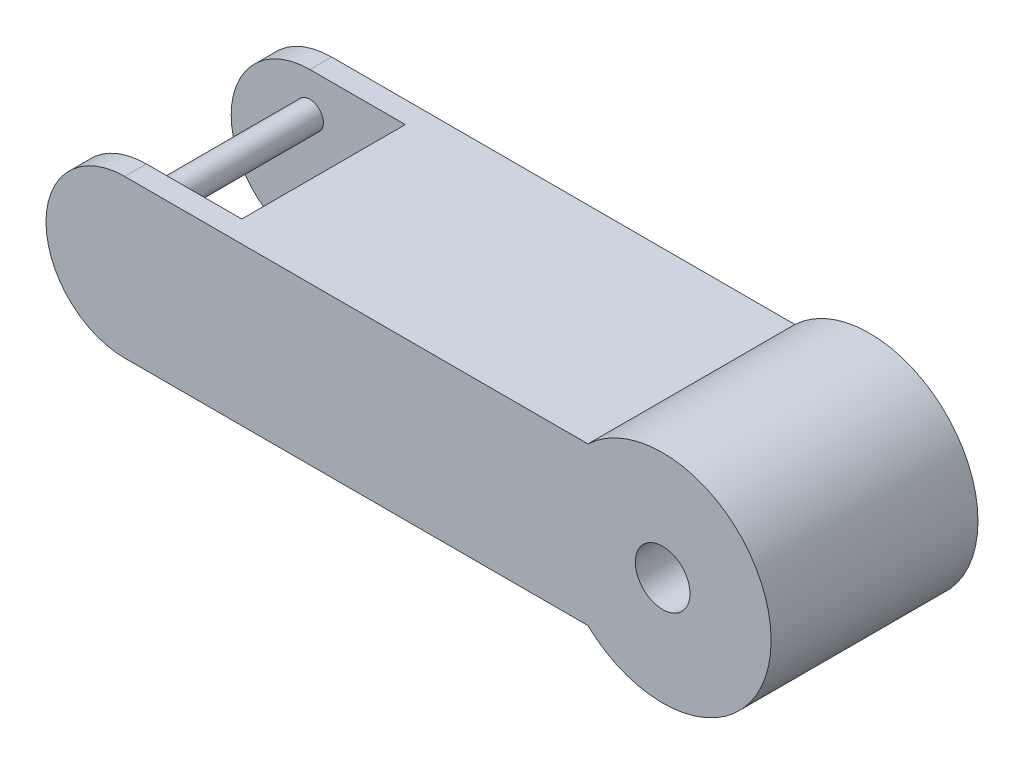
ISO-10303-21;
HEADER;
FILE_DESCRIPTION(('STEP AP214'),'2;1');
FILE_NAME('part.step','',(''),(''),'','','');
FILE_SCHEMA(('AUTOMOTIVE_DESIGN { 1 0 10303 214 1 1 1 1 }'));
ENDSEC;
DATA;
#1=APPLICATION_CONTEXT('core data for automotive mechanical design processes');
#2=APPLICATION_PROTOCOL_DEFINITION('international standard','automotive_design',2000,#1);
#3=PRODUCT_CONTEXT('',#1,'mechanical');
#4=PRODUCT('Part','Part','',(#3));
#5=PRODUCT_RELATED_PRODUCT_CATEGORY('part','',(#4));
#6=PRODUCT_DEFINITION_FORMATION('','',#4);
#7=PRODUCT_DEFINITION_CONTEXT('part definition',#1,'design');
#8=PRODUCT_DEFINITION('design','',#6,#7);
#9=PRODUCT_DEFINITION_SHAPE('','',#8);
#10=(LENGTH_UNIT() NAMED_UNIT(*) SI_UNIT(.MILLI.,.METRE.));
#11=(NAMED_UNIT(*) PLANE_ANGLE_UNIT() SI_UNIT($,.RADIAN.));
#12=(NAMED_UNIT(*) SI_UNIT($,.STERADIAN.) SOLID_ANGLE_UNIT());
#13=UNCERTAINTY_MEASURE_WITH_UNIT(LENGTH_MEASURE(1.E-05),#10,'distance_accuracy_value','');
#14=(GEOMETRIC_REPRESENTATION_CONTEXT(3) GLOBAL_UNCERTAINTY_ASSIGNED_CONTEXT((#13)) GLOBAL_UNIT_ASSIGNED_CONTEXT((#10,
#11,#12)) REPRESENTATION_CONTEXT('',''));
#15=CARTESIAN_POINT('',(0.,0.,0.));
#16=DIRECTION('',(0.,0.,1.));
#17=DIRECTION('',(1.,0.,0.));
#18=AXIS2_PLACEMENT_3D('',#15,#16,#17);
#19=CARTESIAN_POINT('',(0.,0.,4.));
#20=DIRECTION('',(0.,0.,1.));
#21=DIRECTION('',(1.,0.,0.));
#22=AXIS2_PLACEMENT_3D('',#19,#20,#21);
#23=PLANE('',#22);
#24=CARTESIAN_POINT('',(-99.2032764161333,-7.25252561399745,4.));
#25=DIRECTION('',(0.,0.,1.));
#26=DIRECTION('',(1.,0.,0.));
#27=AXIS2_PLACEMENT_3D('',#24,#25,#26);
#28=CIRCLE('',#27,2.50000000000001);
#29=CARTESIAN_POINT('',(-96.7032764161333,-7.25252561399745,4.));
#30=VERTEX_POINT('',#29);
#31=EDGE_CURVE('E11',#30,#30,#28,.T.);
#32=ORIENTED_EDGE('',*,*,#31,.F.);
#33=EDGE_LOOP('',(#32));
#34=FACE_BOUND('',#33,.T.);
#35=CARTESIAN_POINT('',(-99.2032764161333,7.25252561399745,4.));
#36=DIRECTION('',(0.,0.,1.));
#37=DIRECTION('',(1.,0.,0.));
#38=AXIS2_PLACEMENT_3D('',#35,#36,#37);
#39=CIRCLE('',#38,2.50000000000001);
#40=CARTESIAN_POINT('',(-96.7032764161333,7.25252561399745,4.));
#41=VERTEX_POINT('',#40);
#42=EDGE_CURVE('E126',#41,#41,#39,.T.);
#43=ORIENTED_EDGE('',*,*,#42,.F.);
#44=EDGE_LOOP('',(#43));
#45=FACE_BOUND('',#44,.T.);
#46=CARTESIAN_POINT('',(-82.5032784810986,0.,4.));
#47=DIRECTION('',(0.,0.,1.));
#48=DIRECTION('',(1.,0.,0.));
#49=AXIS2_PLACEMENT_3D('',#46,#47,#48);
#50=CIRCLE('',#49,14.532897306423);
#51=CARTESIAN_POINT('',(-81.6040604917987,14.5050512279949,4.));
#52=VERTEX_POINT('',#51);
#53=CARTESIAN_POINT('',(-81.6040604917987,-14.5050512279949,4.));
#54=VERTEX_POINT('',#53);
#55=EDGE_CURVE('E55',#52,#54,#50,.F.);
#56=ORIENTED_EDGE('',*,*,#55,.F.);
#57=DIRECTION('',(-1.,0.,0.));
#58=VECTOR('',#57,1.);
#59=CARTESIAN_POINT('',(0.,14.5050512279949,4.));
#60=LINE('',#59,#58);
#61=CARTESIAN_POINT('',(-99.2032764161333,14.5050512279949,4.));
#62=VERTEX_POINT('',#61);
#63=EDGE_CURVE('E106',#52,#62,#60,.T.);
#64=ORIENTED_EDGE('',*,*,#63,.T.);
#65=CARTESIAN_POINT('',(-99.2032764161333,0.,4.));
#66=DIRECTION('',(0.,0.,1.));
#67=DIRECTION('',(1.,0.,0.));
#68=AXIS2_PLACEMENT_3D('',#65,#66,#67);
#69=CIRCLE('',#68,14.5050512279949);
#70=CARTESIAN_POINT('',(-99.2032764161333,-14.5050512279949,4.));
#71=VERTEX_POINT('',#70);
#72=EDGE_CURVE('E109',#62,#71,#69,.T.);
#73=ORIENTED_EDGE('',*,*,#72,.T.);
#74=DIRECTION('',(-1.,0.,0.));
#75=VECTOR('',#74,1.);
#76=CARTESIAN_POINT('',(0.,-14.5050512279949,4.));
#77=LINE('',#76,#75);
#78=EDGE_CURVE('E63',#54,#71,#77,.T.);
#79=ORIENTED_EDGE('',*,*,#78,.F.);
#80=EDGE_LOOP('',(#56,#64,#73,#79));
#81=FACE_BOUND('',#80,.T.);
#82=ADVANCED_FACE('F39',(#34,#45,#81),#23,.T.);
#83=CARTESIAN_POINT('',(0.,0.,4.));
#84=DIRECTION('',(0.,0.,-1.));
#85=DIRECTION('',(-1.,0.,0.));
#86=AXIS2_PLACEMENT_3D('',#83,#84,#85);
#87=CYLINDRICAL_SURFACE('',#86,20.);
#88=CARTESIAN_POINT('',(0.,0.,0.));
#89=DIRECTION('',(0.,0.,1.));
#90=DIRECTION('',(1.,0.,0.));
#91=AXIS2_PLACEMENT_3D('',#88,#89,#90);
#92=CIRCLE('',#91,20.);
#93=CARTESIAN_POINT('',(-13.7696582700241,-14.5050512279949,0.));
#94=VERTEX_POINT('',#93);
#95=CARTESIAN_POINT('',(-13.7696582700241,14.5050512279949,0.));
#96=VERTEX_POINT('',#95);
#97=EDGE_CURVE('E85',#94,#96,#92,.T.);
#98=ORIENTED_EDGE('',*,*,#97,.T.);
#99=DIRECTION('',(0.,0.,-1.));
#100=VECTOR('',#99,1.);
#101=CARTESIAN_POINT('',(-13.7696582700241,14.5050512279949,4.));
#102=LINE('',#101,#100);
#103=CARTESIAN_POINT('',(-13.7696582700241,14.5050512279949,38.15));
#104=VERTEX_POINT('',#103);
#105=EDGE_CURVE('E118',#104,#96,#102,.T.);
#106=ORIENTED_EDGE('',*,*,#105,.F.);
#107=CARTESIAN_POINT('',(0.,0.,38.15));
#108=DIRECTION('',(0.,0.,1.));
#109=DIRECTION('',(1.,0.,0.));
#110=AXIS2_PLACEMENT_3D('',#107,#108,#109);
#111=CIRCLE('',#110,20.);
#112=CARTESIAN_POINT('',(-13.7696582700241,-14.5050512279949,38.15));
#113=VERTEX_POINT('',#112);
#114=EDGE_CURVE('E88',#113,#104,#111,.T.);
#115=ORIENTED_EDGE('',*,*,#114,.F.);
#116=DIRECTION('',(0.,0.,-1.));
#117=VECTOR('',#116,1.);
#118=CARTESIAN_POINT('',(-13.7696582700241,-14.5050512279949,4.));
#119=LINE('',#118,#117);
#120=EDGE_CURVE('E82',#113,#94,#119,.T.);
#121=ORIENTED_EDGE('',*,*,#120,.T.);
#122=EDGE_LOOP('',(#98,#106,#115,#121));
#123=FACE_BOUND('',#122,.T.);
#124=ADVANCED_FACE('F41',(#123),#87,.T.);
#125=CARTESIAN_POINT('',(0.,14.5050512279949,4.));
#126=DIRECTION('',(0.,-1.,0.));
#127=DIRECTION('',(1.,0.,0.));
#128=AXIS2_PLACEMENT_3D('',#125,#126,#127);
#129=PLANE('',#128);
#130=DIRECTION('',(-1.,0.,0.));
#131=VECTOR('',#130,1.);
#132=CARTESIAN_POINT('',(0.,14.5050512279949,0.));
#133=LINE('',#132,#131);
#134=CARTESIAN_POINT('',(-99.2032764161333,14.5050512279949,0.));
#135=VERTEX_POINT('',#134);
#136=EDGE_CURVE('E99',#96,#135,#133,.T.);
#137=ORIENTED_EDGE('',*,*,#136,.T.);
#138=DIRECTION('',(0.,0.,-1.));
#139=VECTOR('',#138,1.);
#140=CARTESIAN_POINT('',(-99.2032764161333,14.5050512279949,4.));
#141=LINE('',#140,#139);
#142=EDGE_CURVE('E115',#62,#135,#141,.T.);
#143=ORIENTED_EDGE('',*,*,#142,.F.);
#144=ORIENTED_EDGE('',*,*,#63,.F.);
#145=DIRECTION('',(0.,0.,-1.));
#146=VECTOR('',#145,1.);
#147=CARTESIAN_POINT('',(-81.6040604917987,14.5050512279949,19.075));
#148=LINE('',#147,#146);
#149=CARTESIAN_POINT('',(-81.6040604917987,14.5050512279949,34.15));
#150=VERTEX_POINT('',#149);
#151=EDGE_CURVE('E101',#150,#52,#148,.T.);
#152=ORIENTED_EDGE('',*,*,#151,.F.);
#153=DIRECTION('',(-1.,0.,0.));
#154=VECTOR('',#153,1.);
#155=CARTESIAN_POINT('',(0.,14.5050512279949,34.15));
#156=LINE('',#155,#154);
#157=CARTESIAN_POINT('',(-99.2032764161333,14.5050512279949,34.15));
#158=VERTEX_POINT('',#157);
#159=EDGE_CURVE('E139',#150,#158,#156,.T.);
#160=ORIENTED_EDGE('',*,*,#159,.T.);
#161=DIRECTION('',(0.,0.,1.));
#162=VECTOR('',#161,1.);
#163=CARTESIAN_POINT('',(-99.2032764161333,14.5050512279949,34.15));
#164=LINE('',#163,#162);
#165=CARTESIAN_POINT('',(-99.2032764161333,14.5050512279949,38.15));
#166=VERTEX_POINT('',#165);
#167=EDGE_CURVE('E160',#158,#166,#164,.T.);
#168=ORIENTED_EDGE('',*,*,#167,.T.);
#169=DIRECTION('',(-1.,0.,0.));
#170=VECTOR('',#169,1.);
#171=CARTESIAN_POINT('',(0.,14.5050512279949,38.15));
#172=LINE('',#171,#170);
#173=EDGE_CURVE('E151',#104,#166,#172,.T.);
#174=ORIENTED_EDGE('',*,*,#173,.F.);
#175=ORIENTED_EDGE('',*,*,#105,.T.);
#176=EDGE_LOOP('',(#137,#143,#144,#152,#160,#168,#174,#175));
#177=FACE_BOUND('',#176,.T.);
#178=ADVANCED_FACE('F171',(#177),#129,.F.);
#179=CARTESIAN_POINT('',(-99.2032764161333,0.,4.));
#180=DIRECTION('',(0.,0.,-1.));
#181=DIRECTION('',(-1.,0.,0.));
#182=AXIS2_PLACEMENT_3D('',#179,#180,#181);
#183=CYLINDRICAL_SURFACE('',#182,14.5050512279949);
#184=CARTESIAN_POINT('',(-99.2032764161333,0.,0.));
#185=DIRECTION('',(0.,0.,1.));
#186=DIRECTION('',(1.,0.,0.));
#187=AXIS2_PLACEMENT_3D('',#184,#185,#186);
#188=CIRCLE('',#187,14.5050512279949);
#189=CARTESIAN_POINT('',(-99.2032764161333,-14.5050512279949,0.));
#190=VERTEX_POINT('',#189);
#191=EDGE_CURVE('E107',#135,#190,#188,.T.);
#192=ORIENTED_EDGE('',*,*,#191,.T.);
#193=DIRECTION('',(0.,0.,-1.));
#194=VECTOR('',#193,1.);
#195=CARTESIAN_POINT('',(-99.2032764161333,-14.5050512279949,4.));
#196=LINE('',#195,#194);
#197=EDGE_CURVE('E92',#71,#190,#196,.T.);
#198=ORIENTED_EDGE('',*,*,#197,.F.);
#199=ORIENTED_EDGE('',*,*,#72,.F.);
#200=ORIENTED_EDGE('',*,*,#142,.T.);
#201=EDGE_LOOP('',(#192,#198,#199,#200));
#202=FACE_BOUND('',#201,.T.);
#203=ADVANCED_FACE('F175',(#202),#183,.T.);
#204=CARTESIAN_POINT('',(0.,-14.5050512279949,4.));
#205=DIRECTION('',(0.,-1.,0.));
#206=DIRECTION('',(1.,0.,0.));
#207=AXIS2_PLACEMENT_3D('',#204,#205,#206);
#208=PLANE('',#207);
#209=DIRECTION('',(-1.,0.,0.));
#210=VECTOR('',#209,1.);
#211=CARTESIAN_POINT('',(0.,-14.5050512279949,0.));
#212=LINE('',#211,#210);
#213=EDGE_CURVE('E98',#94,#190,#212,.T.);
#214=ORIENTED_EDGE('',*,*,#213,.F.);
#215=ORIENTED_EDGE('',*,*,#120,.F.);
#216=DIRECTION('',(-1.,0.,0.));
#217=VECTOR('',#216,1.);
#218=CARTESIAN_POINT('',(0.,-14.5050512279949,38.15));
#219=LINE('',#218,#217);
#220=CARTESIAN_POINT('',(-99.2032764161333,-14.5050512279949,38.15));
#221=VERTEX_POINT('',#220);
#222=EDGE_CURVE('E143',#113,#221,#219,.T.);
#223=ORIENTED_EDGE('',*,*,#222,.T.);
#224=DIRECTION('',(0.,0.,1.));
#225=VECTOR('',#224,1.);
#226=CARTESIAN_POINT('',(-99.2032764161333,-14.5050512279949,34.15));
#227=LINE('',#226,#225);
#228=CARTESIAN_POINT('',(-99.2032764161333,-14.5050512279949,34.15));
#229=VERTEX_POINT('',#228);
#230=EDGE_CURVE('E149',#229,#221,#227,.T.);
#231=ORIENTED_EDGE('',*,*,#230,.F.);
#232=DIRECTION('',(-1.,0.,0.));
#233=VECTOR('',#232,1.);
#234=CARTESIAN_POINT('',(0.,-14.5050512279949,34.15));
#235=LINE('',#234,#233);
#236=CARTESIAN_POINT('',(-81.6040604917987,-14.5050512279949,34.15));
#237=VERTEX_POINT('',#236);
#238=EDGE_CURVE('E146',#237,#229,#235,.T.);
#239=ORIENTED_EDGE('',*,*,#238,.F.);
#240=DIRECTION('',(0.,0.,-1.));
#241=VECTOR('',#240,1.);
#242=CARTESIAN_POINT('',(-81.6040604917987,-14.5050512279949,19.075));
#243=LINE('',#242,#241);
#244=EDGE_CURVE('E164',#237,#54,#243,.T.);
#245=ORIENTED_EDGE('',*,*,#244,.T.);
#246=ORIENTED_EDGE('',*,*,#78,.T.);
#247=ORIENTED_EDGE('',*,*,#197,.T.);
#248=EDGE_LOOP('',(#214,#215,#223,#231,#239,#245,#246,#247));
#249=FACE_BOUND('',#248,.T.);
#250=ADVANCED_FACE('F103',(#249),#208,.T.);
#251=CARTESIAN_POINT('',(0.,0.,0.));
#252=DIRECTION('',(0.,0.,1.));
#253=DIRECTION('',(1.,0.,0.));
#254=AXIS2_PLACEMENT_3D('',#251,#252,#253);
#255=PLANE('',#254);
#256=CARTESIAN_POINT('',(0.,0.,0.));
#257=DIRECTION('',(0.,0.,-1.));
#258=DIRECTION('',(-1.,0.,0.));
#259=AXIS2_PLACEMENT_3D('',#256,#257,#258);
#260=CIRCLE('',#259,5.05);
#261=CARTESIAN_POINT('',(-5.05,0.,0.));
#262=VERTEX_POINT('',#261);
#263=EDGE_CURVE('E124',#262,#262,#260,.T.);
#264=ORIENTED_EDGE('',*,*,#263,.F.);
#265=EDGE_LOOP('',(#264));
#266=FACE_BOUND('',#265,.T.);
#267=ORIENTED_EDGE('',*,*,#97,.F.);
#268=ORIENTED_EDGE('',*,*,#213,.T.);
#269=ORIENTED_EDGE('',*,*,#191,.F.);
#270=ORIENTED_EDGE('',*,*,#136,.F.);
#271=EDGE_LOOP('',(#267,#268,#269,#270));
#272=FACE_BOUND('',#271,.T.);
#273=ADVANCED_FACE('F96',(#266,#272),#255,.F.);
#274=CARTESIAN_POINT('',(-82.5032784810986,0.,19.075));
#275=DIRECTION('',(0.,0.,-1.));
#276=DIRECTION('',(-1.,0.,0.));
#277=AXIS2_PLACEMENT_3D('',#274,#275,#276);
#278=CYLINDRICAL_SURFACE('',#277,14.532897306423);
#279=ORIENTED_EDGE('',*,*,#55,.T.);
#280=ORIENTED_EDGE('',*,*,#244,.F.);
#281=CARTESIAN_POINT('',(-82.5032784810986,0.,34.15));
#282=DIRECTION('',(0.,0.,1.));
#283=DIRECTION('',(1.,0.,0.));
#284=AXIS2_PLACEMENT_3D('',#281,#282,#283);
#285=CIRCLE('',#284,14.532897306423);
#286=EDGE_CURVE('E123',#150,#237,#285,.F.);
#287=ORIENTED_EDGE('',*,*,#286,.F.);
#288=ORIENTED_EDGE('',*,*,#151,.T.);
#289=EDGE_LOOP('',(#279,#280,#287,#288));
#290=FACE_BOUND('',#289,.T.);
#291=ADVANCED_FACE('F181',(#290),#278,.F.);
#292=CARTESIAN_POINT('',(0.,0.,34.15));
#293=DIRECTION('',(0.,0.,-1.));
#294=DIRECTION('',(1.,0.,0.));
#295=AXIS2_PLACEMENT_3D('',#292,#293,#294);
#296=PLANE('',#295);
#297=CARTESIAN_POINT('',(-99.2032764161333,-7.25252561399745,34.15));
#298=DIRECTION('',(0.,0.,-1.));
#299=DIRECTION('',(-1.,0.,0.));
#300=AXIS2_PLACEMENT_3D('',#297,#298,#299);
#301=CIRCLE('',#300,2.50000000000001);
#302=CARTESIAN_POINT('',(-101.703276416133,-7.25252561399745,34.15));
#303=VERTEX_POINT('',#302);
#304=EDGE_CURVE('E43',#303,#303,#301,.T.);
#305=ORIENTED_EDGE('',*,*,#304,.F.);
#306=EDGE_LOOP('',(#305));
#307=FACE_BOUND('',#306,.T.);
#308=CARTESIAN_POINT('',(-99.2032764161333,7.25252561399745,34.15));
#309=DIRECTION('',(0.,0.,-1.));
#310=DIRECTION('',(-1.,0.,0.));
#311=AXIS2_PLACEMENT_3D('',#308,#309,#310);
#312=CIRCLE('',#311,2.50000000000001);
#313=CARTESIAN_POINT('',(-101.703276416133,7.25252561399745,34.15));
#314=VERTEX_POINT('',#313);
#315=EDGE_CURVE('E120',#314,#314,#312,.T.);
#316=ORIENTED_EDGE('',*,*,#315,.F.);
#317=EDGE_LOOP('',(#316));
#318=FACE_BOUND('',#317,.T.);
#319=ORIENTED_EDGE('',*,*,#286,.T.);
#320=ORIENTED_EDGE('',*,*,#238,.T.);
#321=CARTESIAN_POINT('',(-99.2032764161333,0.,34.15));
#322=DIRECTION('',(0.,0.,1.));
#323=DIRECTION('',(1.,0.,0.));
#324=AXIS2_PLACEMENT_3D('',#321,#322,#323);
#325=CIRCLE('',#324,14.5050512279949);
#326=EDGE_CURVE('E142',#158,#229,#325,.T.);
#327=ORIENTED_EDGE('',*,*,#326,.F.);
#328=ORIENTED_EDGE('',*,*,#159,.F.);
#329=EDGE_LOOP('',(#319,#320,#327,#328));
#330=FACE_BOUND('',#329,.T.);
#331=ADVANCED_FACE('F188',(#307,#318,#330),#296,.T.);
#332=CARTESIAN_POINT('',(-99.2032764161333,0.,34.15));
#333=DIRECTION('',(0.,0.,1.));
#334=DIRECTION('',(-1.,0.,0.));
#335=AXIS2_PLACEMENT_3D('',#332,#333,#334);
#336=CYLINDRICAL_SURFACE('',#335,14.5050512279949);
#337=CARTESIAN_POINT('',(-99.2032764161333,0.,38.15));
#338=DIRECTION('',(0.,0.,1.));
#339=DIRECTION('',(1.,0.,0.));
#340=AXIS2_PLACEMENT_3D('',#337,#338,#339);
#341=CIRCLE('',#340,14.5050512279949);
#342=EDGE_CURVE('E154',#166,#221,#341,.T.);
#343=ORIENTED_EDGE('',*,*,#342,.F.);
#344=ORIENTED_EDGE('',*,*,#167,.F.);
#345=ORIENTED_EDGE('',*,*,#326,.T.);
#346=ORIENTED_EDGE('',*,*,#230,.T.);
#347=EDGE_LOOP('',(#343,#344,#345,#346));
#348=FACE_BOUND('',#347,.T.);
#349=ADVANCED_FACE('F206',(#348),#336,.T.);
#350=CARTESIAN_POINT('',(0.,0.,38.15));
#351=DIRECTION('',(0.,0.,-1.));
#352=DIRECTION('',(1.,0.,0.));
#353=AXIS2_PLACEMENT_3D('',#350,#351,#352);
#354=PLANE('',#353);
#355=CARTESIAN_POINT('',(0.,0.,38.15));
#356=DIRECTION('',(0.,0.,-1.));
#357=DIRECTION('',(-1.,0.,0.));
#358=AXIS2_PLACEMENT_3D('',#355,#356,#357);
#359=CIRCLE('',#358,5.05);
#360=CARTESIAN_POINT('',(-5.05,0.,38.15));
#361=VERTEX_POINT('',#360);
#362=EDGE_CURVE('E121',#361,#361,#359,.T.);
#363=ORIENTED_EDGE('',*,*,#362,.T.);
#364=EDGE_LOOP('',(#363));
#365=FACE_BOUND('',#364,.T.);
#366=ORIENTED_EDGE('',*,*,#114,.T.);
#367=ORIENTED_EDGE('',*,*,#173,.T.);
#368=ORIENTED_EDGE('',*,*,#342,.T.);
#369=ORIENTED_EDGE('',*,*,#222,.F.);
#370=EDGE_LOOP('',(#366,#367,#368,#369));
#371=FACE_BOUND('',#370,.T.);
#372=ADVANCED_FACE('F207',(#365,#371),#354,.F.);
#373=CARTESIAN_POINT('',(0.,0.,51.075));
#374=DIRECTION('',(0.,0.,-1.));
#375=DIRECTION('',(-1.,0.,0.));
#376=AXIS2_PLACEMENT_3D('',#373,#374,#375);
#377=CYLINDRICAL_SURFACE('',#376,5.05);
#378=ORIENTED_EDGE('',*,*,#263,.T.);
#379=EDGE_LOOP('',(#378));
#380=FACE_BOUND('',#379,.T.);
#381=ORIENTED_EDGE('',*,*,#362,.F.);
#382=EDGE_LOOP('',(#381));
#383=FACE_BOUND('',#382,.T.);
#384=ADVANCED_FACE('F209',(#380,#383),#377,.F.);
#385=CARTESIAN_POINT('',(-99.2032764161333,7.25252561399745,36.15));
#386=DIRECTION('',(0.,0.,-1.));
#387=DIRECTION('',(-1.,0.,0.));
#388=AXIS2_PLACEMENT_3D('',#385,#386,#387);
#389=CYLINDRICAL_SURFACE('',#388,2.50000000000001);
#390=ORIENTED_EDGE('',*,*,#42,.T.);
#391=EDGE_LOOP('',(#390));
#392=FACE_BOUND('',#391,.T.);
#393=ORIENTED_EDGE('',*,*,#315,.T.);
#394=EDGE_LOOP('',(#393));
#395=FACE_BOUND('',#394,.T.);
#396=ADVANCED_FACE('F216',(#392,#395),#389,.T.);
#397=CARTESIAN_POINT('',(-99.2032764161333,-7.25252561399745,36.15));
#398=DIRECTION('',(0.,0.,-1.));
#399=DIRECTION('',(-1.,0.,0.));
#400=AXIS2_PLACEMENT_3D('',#397,#398,#399);
#401=CYLINDRICAL_SURFACE('',#400,2.50000000000001);
#402=ORIENTED_EDGE('',*,*,#31,.T.);
#403=EDGE_LOOP('',(#402));
#404=FACE_BOUND('',#403,.T.);
#405=ORIENTED_EDGE('',*,*,#304,.T.);
#406=EDGE_LOOP('',(#405));
#407=FACE_BOUND('',#406,.T.);
#408=ADVANCED_FACE('F300',(#404,#407),#401,.T.);
#409=CLOSED_SHELL('',(#82,#124,#178,#203,#250,#273,#291,#331,#349,#372,#384,#396,#408));
#410=MANIFOLD_SOLID_BREP('B2',#409);
#411=ADVANCED_BREP_SHAPE_REPRESENTATION('',(#18,#410),#14);
#412=SHAPE_DEFINITION_REPRESENTATION(#9,#411);
ENDSEC;
END-ISO-10303-21;
